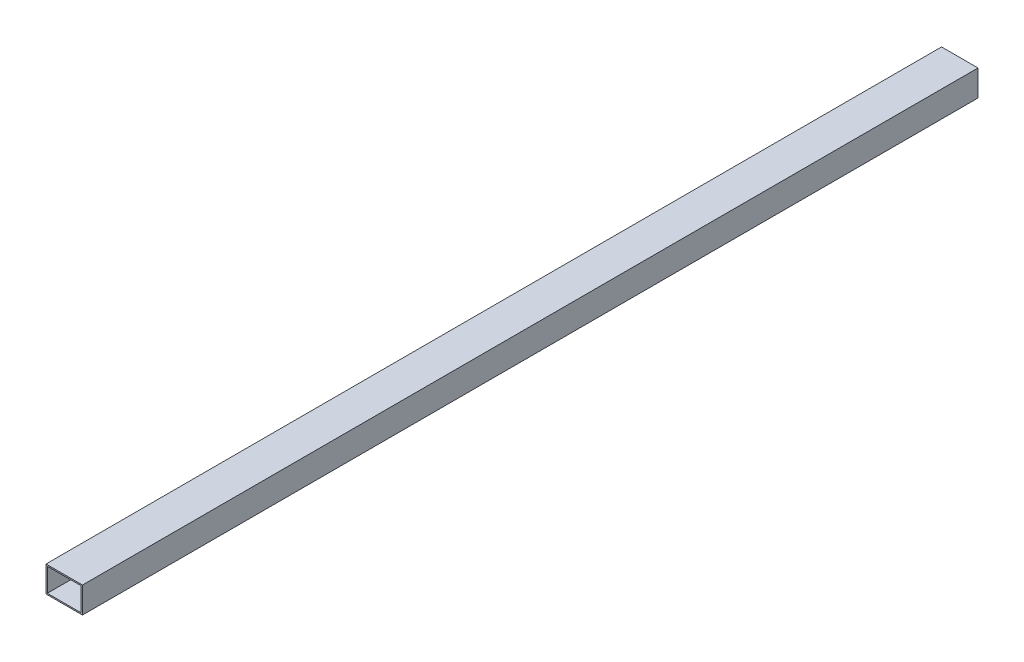
ISO-10303-21;
HEADER;
FILE_DESCRIPTION(('STEP AP214'),'2;1');
FILE_NAME('part.step','',(''),(''),'','','');
FILE_SCHEMA(('AUTOMOTIVE_DESIGN { 1 0 10303 214 1 1 1 1 }'));
ENDSEC;
DATA;
#1=APPLICATION_CONTEXT('core data for automotive mechanical design processes');
#2=APPLICATION_PROTOCOL_DEFINITION('international standard','automotive_design',2000,#1);
#3=PRODUCT_CONTEXT('',#1,'mechanical');
#4=PRODUCT('Part','Part','',(#3));
#5=PRODUCT_RELATED_PRODUCT_CATEGORY('part','',(#4));
#6=PRODUCT_DEFINITION_FORMATION('','',#4);
#7=PRODUCT_DEFINITION_CONTEXT('part definition',#1,'design');
#8=PRODUCT_DEFINITION('design','',#6,#7);
#9=PRODUCT_DEFINITION_SHAPE('','',#8);
#10=(LENGTH_UNIT() NAMED_UNIT(*) SI_UNIT(.MILLI.,.METRE.));
#11=(NAMED_UNIT(*) PLANE_ANGLE_UNIT() SI_UNIT($,.RADIAN.));
#12=(NAMED_UNIT(*) SI_UNIT($,.STERADIAN.) SOLID_ANGLE_UNIT());
#13=UNCERTAINTY_MEASURE_WITH_UNIT(LENGTH_MEASURE(1.E-05),#10,'distance_accuracy_value','');
#14=(GEOMETRIC_REPRESENTATION_CONTEXT(3) GLOBAL_UNCERTAINTY_ASSIGNED_CONTEXT((#13)) GLOBAL_UNIT_ASSIGNED_CONTEXT((#10,
#11,#12)) REPRESENTATION_CONTEXT('',''));
#15=CARTESIAN_POINT('',(0.,0.,0.));
#16=DIRECTION('',(0.,0.,1.));
#17=DIRECTION('',(1.,0.,0.));
#18=AXIS2_PLACEMENT_3D('',#15,#16,#17);
#19=CARTESIAN_POINT('',(-41.2750000000117,-28.5749999999914,2184.4));
#20=DIRECTION('',(-1.,0.,0.));
#21=DIRECTION('',(0.,-1.,0.));
#22=AXIS2_PLACEMENT_3D('',#19,#20,#21);
#23=PLANE('',#22);
#24=DIRECTION('',(0.,0.,1.));
#25=VECTOR('',#24,1.);
#26=CARTESIAN_POINT('',(-41.2750000000117,28.5749999999914,2184.4));
#27=LINE('',#26,#25);
#28=CARTESIAN_POINT('',(-41.2750000000117,28.5749999999914,0.));
#29=VERTEX_POINT('',#28);
#30=CARTESIAN_POINT('',(-41.2750000000117,28.5749999999914,2184.4));
#31=VERTEX_POINT('',#30);
#32=EDGE_CURVE('E20',#29,#31,#27,.T.);
#33=ORIENTED_EDGE('',*,*,#32,.T.);
#34=DIRECTION('',(0.,1.,0.));
#35=VECTOR('',#34,1.);
#36=CARTESIAN_POINT('',(-41.2750000000117,0.,2184.4));
#37=LINE('',#36,#35);
#38=CARTESIAN_POINT('',(-41.2750000000117,-28.5749999999914,2184.4));
#39=VERTEX_POINT('',#38);
#40=EDGE_CURVE('E125',#39,#31,#37,.T.);
#41=ORIENTED_EDGE('',*,*,#40,.F.);
#42=DIRECTION('',(0.,0.,1.));
#43=VECTOR('',#42,1.);
#44=CARTESIAN_POINT('',(-41.2750000000117,-28.5749999999914,2184.4));
#45=LINE('',#44,#43);
#46=CARTESIAN_POINT('',(-41.2750000000117,-28.5749999999914,0.));
#47=VERTEX_POINT('',#46);
#48=EDGE_CURVE('E110',#39,#47,#45,.F.);
#49=ORIENTED_EDGE('',*,*,#48,.T.);
#50=DIRECTION('',(0.,1.,0.));
#51=VECTOR('',#50,1.);
#52=CARTESIAN_POINT('',(-41.2750000000117,0.,0.));
#53=LINE('',#52,#51);
#54=EDGE_CURVE('E105',#47,#29,#53,.T.);
#55=ORIENTED_EDGE('',*,*,#54,.T.);
#56=EDGE_LOOP('',(#33,#41,#49,#55));
#57=FACE_BOUND('',#56,.T.);
#58=ADVANCED_FACE('F17',(#57),#23,.F.);
#59=CARTESIAN_POINT('',(-41.2750000000117,28.5749999999914,2184.4));
#60=DIRECTION('',(0.,1.,0.));
#61=DIRECTION('',(0.,0.,1.));
#62=AXIS2_PLACEMENT_3D('',#59,#60,#61);
#63=PLANE('',#62);
#64=DIRECTION('',(0.,0.,1.));
#65=VECTOR('',#64,1.);
#66=CARTESIAN_POINT('',(41.2750000000117,28.5749999999914,2184.4));
#67=LINE('',#66,#65);
#68=CARTESIAN_POINT('',(41.2750000000117,28.5749999999914,0.));
#69=VERTEX_POINT('',#68);
#70=CARTESIAN_POINT('',(41.2750000000117,28.5749999999914,2184.4));
#71=VERTEX_POINT('',#70);
#72=EDGE_CURVE('E84',#69,#71,#67,.T.);
#73=ORIENTED_EDGE('',*,*,#72,.T.);
#74=DIRECTION('',(1.,0.,0.));
#75=VECTOR('',#74,1.);
#76=CARTESIAN_POINT('',(0.,28.5749999999914,2184.4));
#77=LINE('',#76,#75);
#78=EDGE_CURVE('E123',#31,#71,#77,.T.);
#79=ORIENTED_EDGE('',*,*,#78,.F.);
#80=ORIENTED_EDGE('',*,*,#32,.F.);
#81=DIRECTION('',(1.,0.,0.));
#82=VECTOR('',#81,1.);
#83=CARTESIAN_POINT('',(0.,28.5749999999914,0.));
#84=LINE('',#83,#82);
#85=EDGE_CURVE('E81',#29,#69,#84,.T.);
#86=ORIENTED_EDGE('',*,*,#85,.T.);
#87=EDGE_LOOP('',(#73,#79,#80,#86));
#88=FACE_BOUND('',#87,.T.);
#89=ADVANCED_FACE('F83',(#88),#63,.F.);
#90=CARTESIAN_POINT('',(41.2750000000117,28.5749999999914,2184.4));
#91=DIRECTION('',(1.,0.,0.));
#92=DIRECTION('',(0.,1.,0.));
#93=AXIS2_PLACEMENT_3D('',#90,#91,#92);
#94=PLANE('',#93);
#95=DIRECTION('',(0.,0.,1.));
#96=VECTOR('',#95,1.);
#97=CARTESIAN_POINT('',(41.2750000000117,-28.5749999999914,2184.4));
#98=LINE('',#97,#96);
#99=CARTESIAN_POINT('',(41.2750000000117,-28.5749999999914,0.));
#100=VERTEX_POINT('',#99);
#101=CARTESIAN_POINT('',(41.2750000000117,-28.5749999999914,2184.4));
#102=VERTEX_POINT('',#101);
#103=EDGE_CURVE('E98',#100,#102,#98,.T.);
#104=ORIENTED_EDGE('',*,*,#103,.T.);
#105=DIRECTION('',(0.,1.,0.));
#106=VECTOR('',#105,1.);
#107=CARTESIAN_POINT('',(41.2750000000117,0.,2184.4));
#108=LINE('',#107,#106);
#109=EDGE_CURVE('E96',#71,#102,#108,.F.);
#110=ORIENTED_EDGE('',*,*,#109,.F.);
#111=ORIENTED_EDGE('',*,*,#72,.F.);
#112=DIRECTION('',(0.,1.,0.));
#113=VECTOR('',#112,1.);
#114=CARTESIAN_POINT('',(41.2750000000117,0.,0.));
#115=LINE('',#114,#113);
#116=EDGE_CURVE('E89',#69,#100,#115,.F.);
#117=ORIENTED_EDGE('',*,*,#116,.T.);
#118=EDGE_LOOP('',(#104,#110,#111,#117));
#119=FACE_BOUND('',#118,.T.);
#120=ADVANCED_FACE('F93',(#119),#94,.F.);
#121=CARTESIAN_POINT('',(41.2750000000117,-28.5749999999914,2184.4));
#122=DIRECTION('',(0.,-1.,0.));
#123=DIRECTION('',(1.,0.,0.));
#124=AXIS2_PLACEMENT_3D('',#121,#122,#123);
#125=PLANE('',#124);
#126=ORIENTED_EDGE('',*,*,#48,.F.);
#127=DIRECTION('',(1.,0.,0.));
#128=VECTOR('',#127,1.);
#129=CARTESIAN_POINT('',(0.,-28.5749999999914,2184.4));
#130=LINE('',#129,#128);
#131=EDGE_CURVE('E116',#102,#39,#130,.F.);
#132=ORIENTED_EDGE('',*,*,#131,.F.);
#133=ORIENTED_EDGE('',*,*,#103,.F.);
#134=DIRECTION('',(1.,0.,0.));
#135=VECTOR('',#134,1.);
#136=CARTESIAN_POINT('',(0.,-28.5749999999914,0.));
#137=LINE('',#136,#135);
#138=EDGE_CURVE('E103',#100,#47,#137,.F.);
#139=ORIENTED_EDGE('',*,*,#138,.T.);
#140=EDGE_LOOP('',(#126,#132,#133,#139));
#141=FACE_BOUND('',#140,.T.);
#142=ADVANCED_FACE('F117',(#141),#125,.F.);
#143=CARTESIAN_POINT('',(-44.45,-31.75,0.));
#144=DIRECTION('',(0.,-1.,0.));
#145=DIRECTION('',(1.,0.,0.));
#146=AXIS2_PLACEMENT_3D('',#143,#144,#145);
#147=PLANE('',#146);
#148=DIRECTION('',(1.,0.,0.));
#149=VECTOR('',#148,1.);
#150=CARTESIAN_POINT('',(0.,-31.75,2184.4));
#151=LINE('',#150,#149);
#152=CARTESIAN_POINT('',(-44.45,-31.75,2184.4));
#153=VERTEX_POINT('',#152);
#154=CARTESIAN_POINT('',(44.45,-31.75,2184.4));
#155=VERTEX_POINT('',#154);
#156=EDGE_CURVE('E133',#153,#155,#151,.T.);
#157=ORIENTED_EDGE('',*,*,#156,.F.);
#158=DIRECTION('',(0.,0.,1.));
#159=VECTOR('',#158,1.);
#160=CARTESIAN_POINT('',(-44.45,-31.75,0.));
#161=LINE('',#160,#159);
#162=CARTESIAN_POINT('',(-44.45,-31.75,0.));
#163=VERTEX_POINT('',#162);
#164=EDGE_CURVE('E135',#163,#153,#161,.T.);
#165=ORIENTED_EDGE('',*,*,#164,.F.);
#166=DIRECTION('',(1.,0.,0.));
#167=VECTOR('',#166,1.);
#168=CARTESIAN_POINT('',(0.,-31.75,0.));
#169=LINE('',#168,#167);
#170=CARTESIAN_POINT('',(44.45,-31.75,0.));
#171=VERTEX_POINT('',#170);
#172=EDGE_CURVE('E90',#163,#171,#169,.T.);
#173=ORIENTED_EDGE('',*,*,#172,.T.);
#174=DIRECTION('',(0.,0.,1.));
#175=VECTOR('',#174,1.);
#176=CARTESIAN_POINT('',(44.45,-31.75,0.));
#177=LINE('',#176,#175);
#178=EDGE_CURVE('E239',#155,#171,#177,.F.);
#179=ORIENTED_EDGE('',*,*,#178,.F.);
#180=EDGE_LOOP('',(#157,#165,#173,#179));
#181=FACE_BOUND('',#180,.T.);
#182=ADVANCED_FACE('F166',(#181),#147,.T.);
#183=CARTESIAN_POINT('',(0.,0.,0.));
#184=DIRECTION('',(0.,0.,1.));
#185=DIRECTION('',(1.,0.,0.));
#186=AXIS2_PLACEMENT_3D('',#183,#184,#185);
#187=PLANE('',#186);
#188=ORIENTED_EDGE('',*,*,#138,.F.);
#189=ORIENTED_EDGE('',*,*,#116,.F.);
#190=ORIENTED_EDGE('',*,*,#85,.F.);
#191=ORIENTED_EDGE('',*,*,#54,.F.);
#192=EDGE_LOOP('',(#188,#189,#190,#191));
#193=FACE_BOUND('',#192,.T.);
#194=DIRECTION('',(0.,-1.,0.));
#195=VECTOR('',#194,1.);
#196=CARTESIAN_POINT('',(-44.45,31.75,0.));
#197=LINE('',#196,#195);
#198=CARTESIAN_POINT('',(-44.45,31.75,0.));
#199=VERTEX_POINT('',#198);
#200=EDGE_CURVE('E138',#199,#163,#197,.T.);
#201=ORIENTED_EDGE('',*,*,#200,.F.);
#202=DIRECTION('',(-1.,0.,0.));
#203=VECTOR('',#202,1.);
#204=CARTESIAN_POINT('',(44.45,31.75,0.));
#205=LINE('',#204,#203);
#206=CARTESIAN_POINT('',(44.45,31.75,0.));
#207=VERTEX_POINT('',#206);
#208=EDGE_CURVE('E245',#207,#199,#205,.T.);
#209=ORIENTED_EDGE('',*,*,#208,.F.);
#210=DIRECTION('',(0.,1.,0.));
#211=VECTOR('',#210,1.);
#212=CARTESIAN_POINT('',(44.45,-31.75,0.));
#213=LINE('',#212,#211);
#214=EDGE_CURVE('E120',#171,#207,#213,.T.);
#215=ORIENTED_EDGE('',*,*,#214,.F.);
#216=ORIENTED_EDGE('',*,*,#172,.F.);
#217=EDGE_LOOP('',(#201,#209,#215,#216));
#218=FACE_BOUND('',#217,.T.);
#219=ADVANCED_FACE('F100',(#193,#218),#187,.F.);
#220=CARTESIAN_POINT('',(-44.45,31.75,0.));
#221=DIRECTION('',(-1.,0.,0.));
#222=DIRECTION('',(0.,-1.,0.));
#223=AXIS2_PLACEMENT_3D('',#220,#221,#222);
#224=PLANE('',#223);
#225=DIRECTION('',(0.,1.,0.));
#226=VECTOR('',#225,1.);
#227=CARTESIAN_POINT('',(-44.45,0.,2184.4));
#228=LINE('',#227,#226);
#229=CARTESIAN_POINT('',(-44.45,31.75,2184.4));
#230=VERTEX_POINT('',#229);
#231=EDGE_CURVE('E130',#230,#153,#228,.F.);
#232=ORIENTED_EDGE('',*,*,#231,.F.);
#233=DIRECTION('',(0.,0.,1.));
#234=VECTOR('',#233,1.);
#235=CARTESIAN_POINT('',(-44.45,31.75,0.));
#236=LINE('',#235,#234);
#237=EDGE_CURVE('E242',#199,#230,#236,.T.);
#238=ORIENTED_EDGE('',*,*,#237,.F.);
#239=ORIENTED_EDGE('',*,*,#200,.T.);
#240=ORIENTED_EDGE('',*,*,#164,.T.);
#241=EDGE_LOOP('',(#232,#238,#239,#240));
#242=FACE_BOUND('',#241,.T.);
#243=ADVANCED_FACE('F160',(#242),#224,.T.);
#244=CARTESIAN_POINT('',(0.,0.,2184.4));
#245=DIRECTION('',(0.,0.,1.));
#246=DIRECTION('',(1.,0.,0.));
#247=AXIS2_PLACEMENT_3D('',#244,#245,#246);
#248=PLANE('',#247);
#249=ORIENTED_EDGE('',*,*,#109,.T.);
#250=ORIENTED_EDGE('',*,*,#131,.T.);
#251=ORIENTED_EDGE('',*,*,#40,.T.);
#252=ORIENTED_EDGE('',*,*,#78,.T.);
#253=EDGE_LOOP('',(#249,#250,#251,#252));
#254=FACE_BOUND('',#253,.T.);
#255=DIRECTION('',(-1.,0.,0.));
#256=VECTOR('',#255,1.);
#257=CARTESIAN_POINT('',(44.45,31.75,2184.4));
#258=LINE('',#257,#256);
#259=CARTESIAN_POINT('',(44.45,31.75,2184.4));
#260=VERTEX_POINT('',#259);
#261=EDGE_CURVE('E26',#230,#260,#258,.F.);
#262=ORIENTED_EDGE('',*,*,#261,.F.);
#263=ORIENTED_EDGE('',*,*,#231,.T.);
#264=ORIENTED_EDGE('',*,*,#156,.T.);
#265=DIRECTION('',(0.,1.,0.));
#266=VECTOR('',#265,1.);
#267=CARTESIAN_POINT('',(44.45,-31.75,2184.4));
#268=LINE('',#267,#266);
#269=EDGE_CURVE('E35',#260,#155,#268,.F.);
#270=ORIENTED_EDGE('',*,*,#269,.F.);
#271=EDGE_LOOP('',(#262,#263,#264,#270));
#272=FACE_BOUND('',#271,.T.);
#273=ADVANCED_FACE('F122',(#254,#272),#248,.T.);
#274=CARTESIAN_POINT('',(44.45,-31.75,0.));
#275=DIRECTION('',(1.,0.,0.));
#276=DIRECTION('',(0.,1.,0.));
#277=AXIS2_PLACEMENT_3D('',#274,#275,#276);
#278=PLANE('',#277);
#279=ORIENTED_EDGE('',*,*,#269,.T.);
#280=ORIENTED_EDGE('',*,*,#178,.T.);
#281=ORIENTED_EDGE('',*,*,#214,.T.);
#282=DIRECTION('',(0.,0.,1.));
#283=VECTOR('',#282,1.);
#284=CARTESIAN_POINT('',(44.45,31.75,0.));
#285=LINE('',#284,#283);
#286=EDGE_CURVE('E11',#260,#207,#285,.F.);
#287=ORIENTED_EDGE('',*,*,#286,.F.);
#288=EDGE_LOOP('',(#279,#280,#281,#287));
#289=FACE_BOUND('',#288,.T.);
#290=ADVANCED_FACE('F148',(#289),#278,.T.);
#291=CARTESIAN_POINT('',(44.45,31.75,0.));
#292=DIRECTION('',(0.,1.,0.));
#293=DIRECTION('',(-1.,0.,0.));
#294=AXIS2_PLACEMENT_3D('',#291,#292,#293);
#295=PLANE('',#294);
#296=ORIENTED_EDGE('',*,*,#261,.T.);
#297=ORIENTED_EDGE('',*,*,#286,.T.);
#298=ORIENTED_EDGE('',*,*,#208,.T.);
#299=ORIENTED_EDGE('',*,*,#237,.T.);
#300=EDGE_LOOP('',(#296,#297,#298,#299));
#301=FACE_BOUND('',#300,.T.);
#302=ADVANCED_FACE('F146',(#301),#295,.T.);
#303=CLOSED_SHELL('',(#58,#89,#120,#142,#182,#219,#243,#273,#290,#302));
#304=MANIFOLD_SOLID_BREP('B1',#303);
#305=ADVANCED_BREP_SHAPE_REPRESENTATION('',(#18,#304),#14);
#306=SHAPE_DEFINITION_REPRESENTATION(#9,#305);
ENDSEC;
END-ISO-10303-21;
